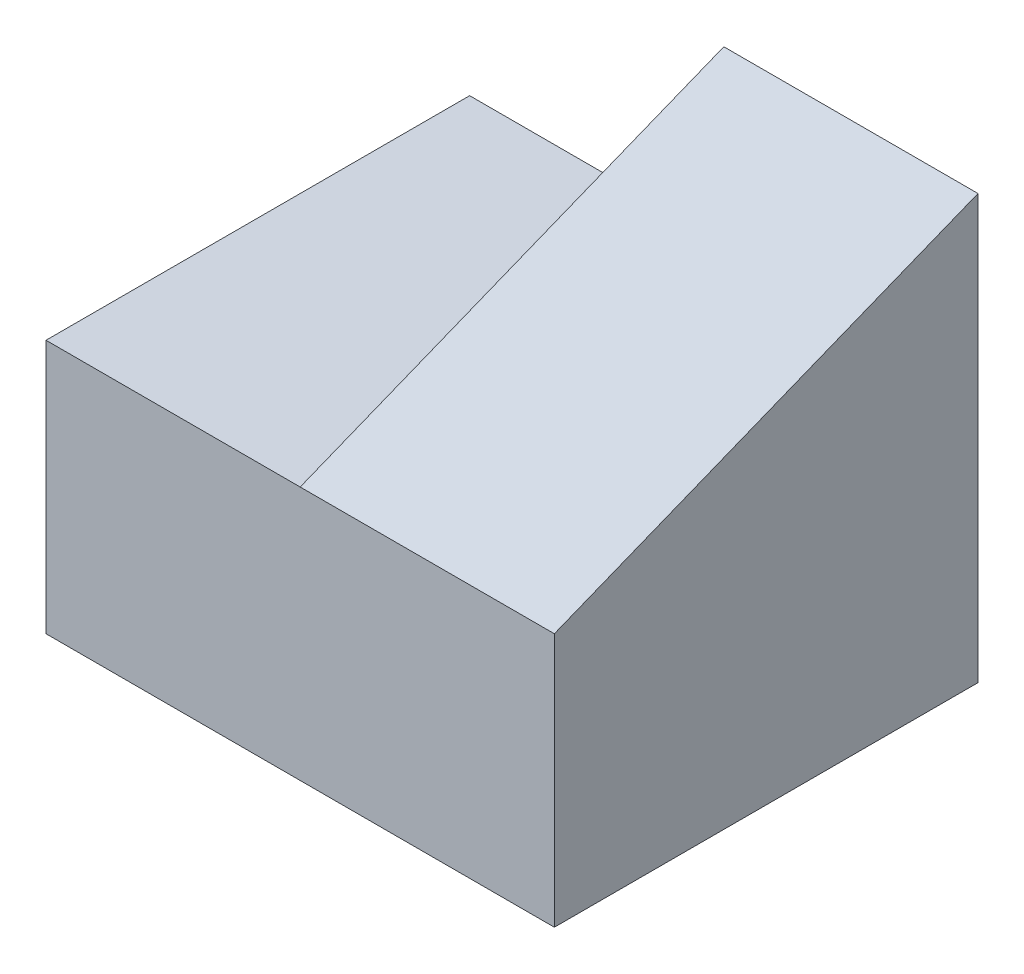
ISO-10303-21;
HEADER;
FILE_DESCRIPTION(('STEP AP214'),'2;1');
FILE_NAME('part.step','',(''),(''),'','','');
FILE_SCHEMA(('AUTOMOTIVE_DESIGN { 1 0 10303 214 1 1 1 1 }'));
ENDSEC;
DATA;
#1=APPLICATION_CONTEXT('core data for automotive mechanical design processes');
#2=APPLICATION_PROTOCOL_DEFINITION('international standard','automotive_design',2000,#1);
#3=PRODUCT_CONTEXT('',#1,'mechanical');
#4=PRODUCT('Part','Part','',(#3));
#5=PRODUCT_RELATED_PRODUCT_CATEGORY('part','',(#4));
#6=PRODUCT_DEFINITION_FORMATION('','',#4);
#7=PRODUCT_DEFINITION_CONTEXT('part definition',#1,'design');
#8=PRODUCT_DEFINITION('design','',#6,#7);
#9=PRODUCT_DEFINITION_SHAPE('','',#8);
#10=(LENGTH_UNIT() NAMED_UNIT(*) SI_UNIT(.MILLI.,.METRE.));
#11=(NAMED_UNIT(*) PLANE_ANGLE_UNIT() SI_UNIT($,.RADIAN.));
#12=(NAMED_UNIT(*) SI_UNIT($,.STERADIAN.) SOLID_ANGLE_UNIT());
#13=UNCERTAINTY_MEASURE_WITH_UNIT(LENGTH_MEASURE(1.E-05),#10,'distance_accuracy_value','');
#14=(GEOMETRIC_REPRESENTATION_CONTEXT(3) GLOBAL_UNCERTAINTY_ASSIGNED_CONTEXT((#13)) GLOBAL_UNIT_ASSIGNED_CONTEXT((#10,
#11,#12)) REPRESENTATION_CONTEXT('',''));
#15=CARTESIAN_POINT('',(0.,0.,0.));
#16=DIRECTION('',(0.,0.,1.));
#17=DIRECTION('',(1.,0.,0.));
#18=AXIS2_PLACEMENT_3D('',#15,#16,#17);
#19=CARTESIAN_POINT('',(0.,0.,25.));
#20=DIRECTION('',(1.,0.,0.));
#21=DIRECTION('',(0.,1.,0.));
#22=AXIS2_PLACEMENT_3D('',#19,#20,#21);
#23=PLANE('',#22);
#24=DIRECTION('',(0.,-1.,0.));
#25=VECTOR('',#24,1.);
#26=CARTESIAN_POINT('',(0.,0.,0.));
#27=LINE('',#26,#25);
#28=CARTESIAN_POINT('',(0.,15.,0.));
#29=VERTEX_POINT('',#28);
#30=CARTESIAN_POINT('',(0.,0.,0.));
#31=VERTEX_POINT('',#30);
#32=EDGE_CURVE('E102',#29,#31,#27,.T.);
#33=ORIENTED_EDGE('',*,*,#32,.T.);
#34=DIRECTION('',(0.,0.,-1.));
#35=VECTOR('',#34,1.);
#36=CARTESIAN_POINT('',(0.,0.,25.));
#37=LINE('',#36,#35);
#38=CARTESIAN_POINT('',(0.,0.,25.));
#39=VERTEX_POINT('',#38);
#40=EDGE_CURVE('E11',#39,#31,#37,.T.);
#41=ORIENTED_EDGE('',*,*,#40,.F.);
#42=DIRECTION('',(0.,-1.,0.));
#43=VECTOR('',#42,1.);
#44=CARTESIAN_POINT('',(0.,0.,25.));
#45=LINE('',#44,#43);
#46=CARTESIAN_POINT('',(0.,15.,25.));
#47=VERTEX_POINT('',#46);
#48=EDGE_CURVE('E120',#47,#39,#45,.T.);
#49=ORIENTED_EDGE('',*,*,#48,.F.);
#50=DIRECTION('',(0.,0.,-1.));
#51=VECTOR('',#50,1.);
#52=CARTESIAN_POINT('',(0.,15.,25.));
#53=LINE('',#52,#51);
#54=EDGE_CURVE('E136',#47,#29,#53,.T.);
#55=ORIENTED_EDGE('',*,*,#54,.T.);
#56=EDGE_LOOP('',(#33,#41,#49,#55));
#57=FACE_BOUND('',#56,.T.);
#58=ADVANCED_FACE('F33',(#57),#23,.F.);
#59=CARTESIAN_POINT('',(0.,0.,25.));
#60=DIRECTION('',(0.,1.,0.));
#61=DIRECTION('',(0.,0.,1.));
#62=AXIS2_PLACEMENT_3D('',#59,#60,#61);
#63=PLANE('',#62);
#64=DIRECTION('',(1.,0.,0.));
#65=VECTOR('',#64,1.);
#66=CARTESIAN_POINT('',(0.,0.,0.));
#67=LINE('',#66,#65);
#68=CARTESIAN_POINT('',(30.,0.,0.));
#69=VERTEX_POINT('',#68);
#70=EDGE_CURVE('E141',#31,#69,#67,.T.);
#71=ORIENTED_EDGE('',*,*,#70,.T.);
#72=DIRECTION('',(0.,0.,-1.));
#73=VECTOR('',#72,1.);
#74=CARTESIAN_POINT('',(30.,0.,25.));
#75=LINE('',#74,#73);
#76=CARTESIAN_POINT('',(30.,0.,25.));
#77=VERTEX_POINT('',#76);
#78=EDGE_CURVE('E41',#77,#69,#75,.T.);
#79=ORIENTED_EDGE('',*,*,#78,.F.);
#80=DIRECTION('',(1.,0.,0.));
#81=VECTOR('',#80,1.);
#82=CARTESIAN_POINT('',(0.,0.,25.));
#83=LINE('',#82,#81);
#84=EDGE_CURVE('E80',#39,#77,#83,.T.);
#85=ORIENTED_EDGE('',*,*,#84,.F.);
#86=ORIENTED_EDGE('',*,*,#40,.T.);
#87=EDGE_LOOP('',(#71,#79,#85,#86));
#88=FACE_BOUND('',#87,.T.);
#89=ADVANCED_FACE('F158',(#88),#63,.F.);
#90=CARTESIAN_POINT('',(30.,0.,25.));
#91=DIRECTION('',(-1.,0.,0.));
#92=DIRECTION('',(0.,-1.,0.));
#93=AXIS2_PLACEMENT_3D('',#90,#91,#92);
#94=PLANE('',#93);
#95=DIRECTION('',(0.,1.,0.));
#96=VECTOR('',#95,1.);
#97=CARTESIAN_POINT('',(30.,0.,0.));
#98=LINE('',#97,#96);
#99=CARTESIAN_POINT('',(30.,25.,0.));
#100=VERTEX_POINT('',#99);
#101=EDGE_CURVE('E131',#69,#100,#98,.T.);
#102=ORIENTED_EDGE('',*,*,#101,.T.);
#103=DIRECTION('',(0.,-0.371390676354104,0.928476690885259));
#104=VECTOR('',#103,1.);
#105=CARTESIAN_POINT('',(30.,25.,0.));
#106=LINE('',#105,#104);
#107=CARTESIAN_POINT('',(30.,15.,25.));
#108=VERTEX_POINT('',#107);
#109=EDGE_CURVE('E99',#100,#108,#106,.T.);
#110=ORIENTED_EDGE('',*,*,#109,.T.);
#111=DIRECTION('',(0.,1.,0.));
#112=VECTOR('',#111,1.);
#113=CARTESIAN_POINT('',(30.,0.,25.));
#114=LINE('',#113,#112);
#115=EDGE_CURVE('E123',#77,#108,#114,.T.);
#116=ORIENTED_EDGE('',*,*,#115,.F.);
#117=ORIENTED_EDGE('',*,*,#78,.T.);
#118=EDGE_LOOP('',(#102,#110,#116,#117));
#119=FACE_BOUND('',#118,.T.);
#120=ADVANCED_FACE('F140',(#119),#94,.F.);
#121=CARTESIAN_POINT('',(0.,15.,25.));
#122=DIRECTION('',(0.,-1.,0.));
#123=DIRECTION('',(0.,0.,-1.));
#124=AXIS2_PLACEMENT_3D('',#121,#122,#123);
#125=PLANE('',#124);
#126=DIRECTION('',(-1.,0.,0.));
#127=VECTOR('',#126,1.);
#128=CARTESIAN_POINT('',(0.,15.,25.));
#129=LINE('',#128,#127);
#130=CARTESIAN_POINT('',(15.,15.,25.));
#131=VERTEX_POINT('',#130);
#132=EDGE_CURVE('E58',#131,#47,#129,.T.);
#133=ORIENTED_EDGE('',*,*,#132,.F.);
#134=DIRECTION('',(0.,0.,-1.));
#135=VECTOR('',#134,1.);
#136=CARTESIAN_POINT('',(15.,15.,25.));
#137=LINE('',#136,#135);
#138=CARTESIAN_POINT('',(15.,15.,0.));
#139=VERTEX_POINT('',#138);
#140=EDGE_CURVE('E106',#131,#139,#137,.T.);
#141=ORIENTED_EDGE('',*,*,#140,.T.);
#142=DIRECTION('',(-1.,0.,0.));
#143=VECTOR('',#142,1.);
#144=CARTESIAN_POINT('',(0.,15.,0.));
#145=LINE('',#144,#143);
#146=EDGE_CURVE('E75',#139,#29,#145,.T.);
#147=ORIENTED_EDGE('',*,*,#146,.T.);
#148=ORIENTED_EDGE('',*,*,#54,.F.);
#149=EDGE_LOOP('',(#133,#141,#147,#148));
#150=FACE_BOUND('',#149,.T.);
#151=ADVANCED_FACE('F146',(#150),#125,.F.);
#152=CARTESIAN_POINT('',(0.,0.,25.));
#153=DIRECTION('',(0.,0.,-1.));
#154=DIRECTION('',(-1.,0.,0.));
#155=AXIS2_PLACEMENT_3D('',#152,#153,#154);
#156=PLANE('',#155);
#157=ORIENTED_EDGE('',*,*,#48,.T.);
#158=ORIENTED_EDGE('',*,*,#84,.T.);
#159=ORIENTED_EDGE('',*,*,#115,.T.);
#160=EDGE_CURVE('E114',#108,#131,#129,.T.);
#161=ORIENTED_EDGE('',*,*,#160,.T.);
#162=ORIENTED_EDGE('',*,*,#132,.T.);
#163=EDGE_LOOP('',(#157,#158,#159,#161,#162));
#164=FACE_BOUND('',#163,.T.);
#165=ADVANCED_FACE('F147',(#164),#156,.F.);
#166=CARTESIAN_POINT('',(0.,0.,0.));
#167=DIRECTION('',(0.,0.,-1.));
#168=DIRECTION('',(-1.,0.,0.));
#169=AXIS2_PLACEMENT_3D('',#166,#167,#168);
#170=PLANE('',#169);
#171=ORIENTED_EDGE('',*,*,#32,.F.);
#172=ORIENTED_EDGE('',*,*,#146,.F.);
#173=DIRECTION('',(0.,1.,0.));
#174=VECTOR('',#173,1.);
#175=CARTESIAN_POINT('',(15.,15.,0.));
#176=LINE('',#175,#174);
#177=CARTESIAN_POINT('',(15.,25.,0.));
#178=VERTEX_POINT('',#177);
#179=EDGE_CURVE('E49',#139,#178,#176,.T.);
#180=ORIENTED_EDGE('',*,*,#179,.T.);
#181=DIRECTION('',(1.,0.,0.));
#182=VECTOR('',#181,1.);
#183=CARTESIAN_POINT('',(15.,25.,0.));
#184=LINE('',#183,#182);
#185=EDGE_CURVE('E95',#178,#100,#184,.T.);
#186=ORIENTED_EDGE('',*,*,#185,.T.);
#187=ORIENTED_EDGE('',*,*,#101,.F.);
#188=ORIENTED_EDGE('',*,*,#70,.F.);
#189=EDGE_LOOP('',(#171,#172,#180,#186,#187,#188));
#190=FACE_BOUND('',#189,.T.);
#191=ADVANCED_FACE('F105',(#190),#170,.T.);
#192=CARTESIAN_POINT('',(15.,25.,0.));
#193=DIRECTION('',(0.,0.928476690885259,0.371390676354104));
#194=DIRECTION('',(0.,-0.371390676354104,0.928476690885259));
#195=AXIS2_PLACEMENT_3D('',#192,#193,#194);
#196=PLANE('',#195);
#197=ORIENTED_EDGE('',*,*,#109,.F.);
#198=ORIENTED_EDGE('',*,*,#185,.F.);
#199=DIRECTION('',(0.,-0.371390676354104,0.928476690885259));
#200=VECTOR('',#199,1.);
#201=CARTESIAN_POINT('',(15.,25.,0.));
#202=LINE('',#201,#200);
#203=EDGE_CURVE('E97',#178,#131,#202,.T.);
#204=ORIENTED_EDGE('',*,*,#203,.T.);
#205=ORIENTED_EDGE('',*,*,#160,.F.);
#206=EDGE_LOOP('',(#197,#198,#204,#205));
#207=FACE_BOUND('',#206,.T.);
#208=ADVANCED_FACE('F96',(#207),#196,.T.);
#209=CARTESIAN_POINT('',(15.,0.,0.));
#210=DIRECTION('',(1.,0.,0.));
#211=DIRECTION('',(0.,1.,0.));
#212=AXIS2_PLACEMENT_3D('',#209,#210,#211);
#213=PLANE('',#212);
#214=ORIENTED_EDGE('',*,*,#140,.F.);
#215=ORIENTED_EDGE('',*,*,#203,.F.);
#216=ORIENTED_EDGE('',*,*,#179,.F.);
#217=EDGE_LOOP('',(#214,#215,#216));
#218=FACE_BOUND('',#217,.T.);
#219=ADVANCED_FACE('F108',(#218),#213,.F.);
#220=CLOSED_SHELL('',(#58,#89,#120,#151,#165,#191,#208,#219));
#221=MANIFOLD_SOLID_BREP('B2',#220);
#222=ADVANCED_BREP_SHAPE_REPRESENTATION('',(#18,#221),#14);
#223=SHAPE_DEFINITION_REPRESENTATION(#9,#222);
ENDSEC;
END-ISO-10303-21;
